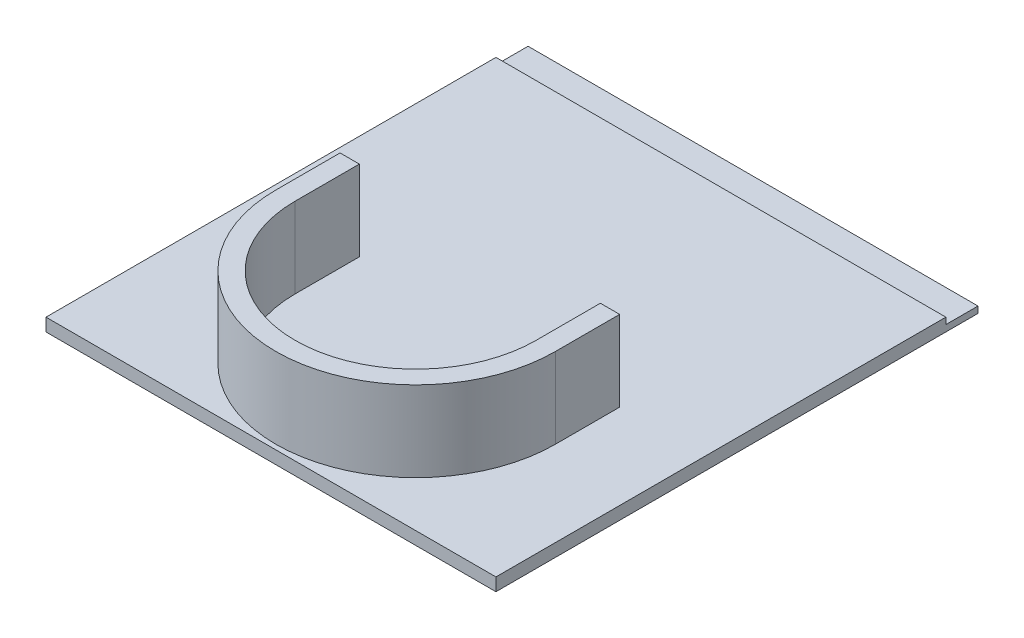
ISO-10303-21;
HEADER;
FILE_DESCRIPTION(('STEP AP214'),'2;1');
FILE_NAME('part.step','',(''),(''),'','','');
FILE_SCHEMA(('AUTOMOTIVE_DESIGN { 1 0 10303 214 1 1 1 1 }'));
ENDSEC;
DATA;
#1=APPLICATION_CONTEXT('core data for automotive mechanical design processes');
#2=APPLICATION_PROTOCOL_DEFINITION('international standard','automotive_design',2000,#1);
#3=PRODUCT_CONTEXT('',#1,'mechanical');
#4=PRODUCT('Part','Part','',(#3));
#5=PRODUCT_RELATED_PRODUCT_CATEGORY('part','',(#4));
#6=PRODUCT_DEFINITION_FORMATION('','',#4);
#7=PRODUCT_DEFINITION_CONTEXT('part definition',#1,'design');
#8=PRODUCT_DEFINITION('design','',#6,#7);
#9=PRODUCT_DEFINITION_SHAPE('','',#8);
#10=(LENGTH_UNIT() NAMED_UNIT(*) SI_UNIT(.MILLI.,.METRE.));
#11=(NAMED_UNIT(*) PLANE_ANGLE_UNIT() SI_UNIT($,.RADIAN.));
#12=(NAMED_UNIT(*) SI_UNIT($,.STERADIAN.) SOLID_ANGLE_UNIT());
#13=UNCERTAINTY_MEASURE_WITH_UNIT(LENGTH_MEASURE(1.E-05),#10,'distance_accuracy_value','');
#14=(GEOMETRIC_REPRESENTATION_CONTEXT(3) GLOBAL_UNCERTAINTY_ASSIGNED_CONTEXT((#13)) GLOBAL_UNIT_ASSIGNED_CONTEXT((#10,
#11,#12)) REPRESENTATION_CONTEXT('',''));
#15=CARTESIAN_POINT('',(0.,0.,0.));
#16=DIRECTION('',(0.,0.,1.));
#17=DIRECTION('',(1.,0.,0.));
#18=AXIS2_PLACEMENT_3D('',#15,#16,#17);
#19=CARTESIAN_POINT('',(0.,4.,0.));
#20=DIRECTION('',(0.,1.,0.));
#21=DIRECTION('',(0.,0.,1.));
#22=AXIS2_PLACEMENT_3D('',#19,#20,#21);
#23=PLANE('',#22);
#24=DIRECTION('',(0.,0.,1.));
#25=VECTOR('',#24,1.);
#26=CARTESIAN_POINT('',(-43.5,4.,145.));
#27=LINE('',#26,#25);
#28=CARTESIAN_POINT('',(-43.5,4.,145.));
#29=VERTEX_POINT('',#28);
#30=CARTESIAN_POINT('',(-43.5,4.,165.));
#31=VERTEX_POINT('',#30);
#32=EDGE_CURVE('E225',#29,#31,#27,.T.);
#33=ORIENTED_EDGE('',*,*,#32,.F.);
#34=DIRECTION('',(-1.,0.,0.));
#35=VECTOR('',#34,1.);
#36=CARTESIAN_POINT('',(-37.5,4.,145.));
#37=LINE('',#36,#35);
#38=CARTESIAN_POINT('',(-37.5,4.,145.));
#39=VERTEX_POINT('',#38);
#40=EDGE_CURVE('E190',#39,#29,#37,.T.);
#41=ORIENTED_EDGE('',*,*,#40,.F.);
#42=DIRECTION('',(0.,0.,-1.));
#43=VECTOR('',#42,1.);
#44=CARTESIAN_POINT('',(-37.5,4.,165.));
#45=LINE('',#44,#43);
#46=CARTESIAN_POINT('',(-37.5,4.,165.));
#47=VERTEX_POINT('',#46);
#48=EDGE_CURVE('E196',#47,#39,#45,.T.);
#49=ORIENTED_EDGE('',*,*,#48,.F.);
#50=CARTESIAN_POINT('',(0.,4.,165.));
#51=DIRECTION('',(0.,1.,0.));
#52=DIRECTION('',(0.,0.,1.));
#53=AXIS2_PLACEMENT_3D('',#50,#51,#52);
#54=CIRCLE('',#53,37.5);
#55=CARTESIAN_POINT('',(37.5,4.,165.));
#56=VERTEX_POINT('',#55);
#57=EDGE_CURVE('E67',#47,#56,#54,.T.);
#58=ORIENTED_EDGE('',*,*,#57,.T.);
#59=DIRECTION('',(0.,0.,-1.));
#60=VECTOR('',#59,1.);
#61=CARTESIAN_POINT('',(37.5,4.,165.));
#62=LINE('',#61,#60);
#63=CARTESIAN_POINT('',(37.5,4.,145.));
#64=VERTEX_POINT('',#63);
#65=EDGE_CURVE('E240',#56,#64,#62,.T.);
#66=ORIENTED_EDGE('',*,*,#65,.T.);
#67=DIRECTION('',(1.,0.,0.));
#68=VECTOR('',#67,1.);
#69=CARTESIAN_POINT('',(37.5,4.,145.));
#70=LINE('',#69,#68);
#71=CARTESIAN_POINT('',(43.5,4.,145.));
#72=VERTEX_POINT('',#71);
#73=EDGE_CURVE('E236',#64,#72,#70,.T.);
#74=ORIENTED_EDGE('',*,*,#73,.T.);
#75=DIRECTION('',(0.,0.,1.));
#76=VECTOR('',#75,1.);
#77=CARTESIAN_POINT('',(43.5,4.,145.));
#78=LINE('',#77,#76);
#79=CARTESIAN_POINT('',(43.5,4.,165.));
#80=VERTEX_POINT('',#79);
#81=EDGE_CURVE('E232',#72,#80,#78,.T.);
#82=ORIENTED_EDGE('',*,*,#81,.T.);
#83=CARTESIAN_POINT('',(0.,4.,165.));
#84=DIRECTION('',(0.,1.,0.));
#85=DIRECTION('',(0.,0.,1.));
#86=AXIS2_PLACEMENT_3D('',#83,#84,#85);
#87=CIRCLE('',#86,43.5);
#88=EDGE_CURVE('E228',#31,#80,#87,.T.);
#89=ORIENTED_EDGE('',*,*,#88,.F.);
#90=EDGE_LOOP('',(#33,#41,#49,#58,#66,#74,#82,#89));
#91=FACE_BOUND('',#90,.T.);
#92=DIRECTION('',(0.,0.,-1.));
#93=VECTOR('',#92,1.);
#94=CARTESIAN_POINT('',(70.,4.,-210.));
#95=LINE('',#94,#93);
#96=CARTESIAN_POINT('',(70.,4.,210.));
#97=VERTEX_POINT('',#96);
#98=CARTESIAN_POINT('',(70.,4.00000000000001,69.9999999999999));
#99=VERTEX_POINT('',#98);
#100=EDGE_CURVE('E274',#97,#99,#95,.T.);
#101=ORIENTED_EDGE('',*,*,#100,.T.);
#102=DIRECTION('',(-1.,0.,0.));
#103=VECTOR('',#102,1.);
#104=CARTESIAN_POINT('',(0.,4.,69.9999999999999));
#105=LINE('',#104,#103);
#106=CARTESIAN_POINT('',(-70.,4.00000000000001,69.9999999999999));
#107=VERTEX_POINT('',#106);
#108=EDGE_CURVE('E184',#99,#107,#105,.T.);
#109=ORIENTED_EDGE('',*,*,#108,.T.);
#110=DIRECTION('',(0.,0.,1.));
#111=VECTOR('',#110,1.);
#112=CARTESIAN_POINT('',(-70.,4.,-210.));
#113=LINE('',#112,#111);
#114=CARTESIAN_POINT('',(-70.,4.,210.));
#115=VERTEX_POINT('',#114);
#116=EDGE_CURVE('E278',#107,#115,#113,.T.);
#117=ORIENTED_EDGE('',*,*,#116,.T.);
#118=DIRECTION('',(1.,0.,0.));
#119=VECTOR('',#118,1.);
#120=CARTESIAN_POINT('',(-70.,4.,210.));
#121=LINE('',#120,#119);
#122=EDGE_CURVE('E282',#115,#97,#121,.T.);
#123=ORIENTED_EDGE('',*,*,#122,.T.);
#124=EDGE_LOOP('',(#101,#109,#117,#123));
#125=FACE_BOUND('',#124,.T.);
#126=ADVANCED_FACE('F43',(#91,#125),#23,.T.);
#127=CARTESIAN_POINT('',(70.,4.,-210.));
#128=DIRECTION('',(-1.,0.,0.));
#129=DIRECTION('',(0.,0.,1.));
#130=AXIS2_PLACEMENT_3D('',#127,#128,#129);
#131=PLANE('',#130);
#132=DIRECTION('',(0.,-1.,0.));
#133=VECTOR('',#132,1.);
#134=CARTESIAN_POINT('',(70.,29.,69.9999999999999));
#135=LINE('',#134,#133);
#136=CARTESIAN_POINT('',(70.,2.,69.9999999999999));
#137=VERTEX_POINT('',#136);
#138=EDGE_CURVE('E180',#99,#137,#135,.T.);
#139=ORIENTED_EDGE('',*,*,#138,.F.);
#140=ORIENTED_EDGE('',*,*,#100,.F.);
#141=DIRECTION('',(0.,-1.,0.));
#142=VECTOR('',#141,1.);
#143=CARTESIAN_POINT('',(70.,4.,210.));
#144=LINE('',#143,#142);
#145=CARTESIAN_POINT('',(70.,0.,210.));
#146=VERTEX_POINT('',#145);
#147=EDGE_CURVE('E52',#97,#146,#144,.T.);
#148=ORIENTED_EDGE('',*,*,#147,.T.);
#149=DIRECTION('',(0.,0.,-1.));
#150=VECTOR('',#149,1.);
#151=CARTESIAN_POINT('',(70.,0.,-210.));
#152=LINE('',#151,#150);
#153=CARTESIAN_POINT('',(70.,0.,59.9999999999999));
#154=VERTEX_POINT('',#153);
#155=EDGE_CURVE('E273',#146,#154,#152,.T.);
#156=ORIENTED_EDGE('',*,*,#155,.T.);
#157=DIRECTION('',(0.,-1.,0.));
#158=VECTOR('',#157,1.);
#159=CARTESIAN_POINT('',(70.,2.,59.9999999999999));
#160=LINE('',#159,#158);
#161=CARTESIAN_POINT('',(70.,2.,59.9999999999999));
#162=VERTEX_POINT('',#161);
#163=EDGE_CURVE('E156',#162,#154,#160,.T.);
#164=ORIENTED_EDGE('',*,*,#163,.F.);
#165=DIRECTION('',(0.,0.,-1.));
#166=VECTOR('',#165,1.);
#167=CARTESIAN_POINT('',(70.,2.,69.9999999999999));
#168=LINE('',#167,#166);
#169=EDGE_CURVE('E163',#137,#162,#168,.T.);
#170=ORIENTED_EDGE('',*,*,#169,.F.);
#171=EDGE_LOOP('',(#139,#140,#148,#156,#164,#170));
#172=FACE_BOUND('',#171,.T.);
#173=ADVANCED_FACE('F45',(#172),#131,.F.);
#174=CARTESIAN_POINT('',(-70.,4.,-210.));
#175=DIRECTION('',(1.,0.,0.));
#176=DIRECTION('',(0.,0.,-1.));
#177=AXIS2_PLACEMENT_3D('',#174,#175,#176);
#178=PLANE('',#177);
#179=DIRECTION('',(0.,-1.,0.));
#180=VECTOR('',#179,1.);
#181=CARTESIAN_POINT('',(-70.,29.,69.9999999999999));
#182=LINE('',#181,#180);
#183=CARTESIAN_POINT('',(-70.,2.00000000000001,69.9999999999999));
#184=VERTEX_POINT('',#183);
#185=EDGE_CURVE('E169',#107,#184,#182,.T.);
#186=ORIENTED_EDGE('',*,*,#185,.T.);
#187=DIRECTION('',(0.,0.,-1.));
#188=VECTOR('',#187,1.);
#189=CARTESIAN_POINT('',(-70.,2.,69.9999999999999));
#190=LINE('',#189,#188);
#191=CARTESIAN_POINT('',(-70.,2.,59.9999999999999));
#192=VERTEX_POINT('',#191);
#193=EDGE_CURVE('E161',#184,#192,#190,.T.);
#194=ORIENTED_EDGE('',*,*,#193,.T.);
#195=DIRECTION('',(0.,-1.,0.));
#196=VECTOR('',#195,1.);
#197=CARTESIAN_POINT('',(-70.,2.,59.9999999999999));
#198=LINE('',#197,#196);
#199=CARTESIAN_POINT('',(-70.,0.,59.9999999999999));
#200=VERTEX_POINT('',#199);
#201=EDGE_CURVE('E146',#192,#200,#198,.T.);
#202=ORIENTED_EDGE('',*,*,#201,.T.);
#203=DIRECTION('',(0.,0.,1.));
#204=VECTOR('',#203,1.);
#205=CARTESIAN_POINT('',(-70.,0.,-210.));
#206=LINE('',#205,#204);
#207=CARTESIAN_POINT('',(-70.,0.,210.));
#208=VERTEX_POINT('',#207);
#209=EDGE_CURVE('E287',#200,#208,#206,.T.);
#210=ORIENTED_EDGE('',*,*,#209,.T.);
#211=DIRECTION('',(0.,-1.,0.));
#212=VECTOR('',#211,1.);
#213=CARTESIAN_POINT('',(-70.,4.,210.));
#214=LINE('',#213,#212);
#215=EDGE_CURVE('E11',#115,#208,#214,.T.);
#216=ORIENTED_EDGE('',*,*,#215,.F.);
#217=ORIENTED_EDGE('',*,*,#116,.F.);
#218=EDGE_LOOP('',(#186,#194,#202,#210,#216,#217));
#219=FACE_BOUND('',#218,.T.);
#220=ADVANCED_FACE('F167',(#219),#178,.F.);
#221=CARTESIAN_POINT('',(0.,0.,0.));
#222=DIRECTION('',(0.,1.,0.));
#223=DIRECTION('',(0.,0.,1.));
#224=AXIS2_PLACEMENT_3D('',#221,#222,#223);
#225=PLANE('',#224);
#226=ORIENTED_EDGE('',*,*,#209,.F.);
#227=DIRECTION('',(1.,0.,0.));
#228=VECTOR('',#227,1.);
#229=CARTESIAN_POINT('',(-70.,0.,59.9999999999999));
#230=LINE('',#229,#228);
#231=EDGE_CURVE('E152',#200,#154,#230,.T.);
#232=ORIENTED_EDGE('',*,*,#231,.T.);
#233=ORIENTED_EDGE('',*,*,#155,.F.);
#234=DIRECTION('',(1.,0.,0.));
#235=VECTOR('',#234,1.);
#236=CARTESIAN_POINT('',(-70.,0.,210.));
#237=LINE('',#236,#235);
#238=EDGE_CURVE('E279',#208,#146,#237,.T.);
#239=ORIENTED_EDGE('',*,*,#238,.F.);
#240=EDGE_LOOP('',(#226,#232,#233,#239));
#241=FACE_BOUND('',#240,.T.);
#242=ADVANCED_FACE('F302',(#241),#225,.F.);
#243=CARTESIAN_POINT('',(-70.,4.,210.));
#244=DIRECTION('',(0.,0.,-1.));
#245=DIRECTION('',(-1.,0.,0.));
#246=AXIS2_PLACEMENT_3D('',#243,#244,#245);
#247=PLANE('',#246);
#248=ORIENTED_EDGE('',*,*,#238,.T.);
#249=ORIENTED_EDGE('',*,*,#147,.F.);
#250=ORIENTED_EDGE('',*,*,#122,.F.);
#251=ORIENTED_EDGE('',*,*,#215,.T.);
#252=EDGE_LOOP('',(#248,#249,#250,#251));
#253=FACE_BOUND('',#252,.T.);
#254=ADVANCED_FACE('F304',(#253),#247,.F.);
#255=CARTESIAN_POINT('',(-37.5,29.,145.));
#256=DIRECTION('',(0.,0.,1.));
#257=DIRECTION('',(1.,0.,0.));
#258=AXIS2_PLACEMENT_3D('',#255,#256,#257);
#259=PLANE('',#258);
#260=ORIENTED_EDGE('',*,*,#40,.T.);
#261=DIRECTION('',(0.,-1.,0.));
#262=VECTOR('',#261,1.);
#263=CARTESIAN_POINT('',(-43.5,29.,145.));
#264=LINE('',#263,#262);
#265=CARTESIAN_POINT('',(-43.5,29.,145.));
#266=VERTEX_POINT('',#265);
#267=EDGE_CURVE('E270',#266,#29,#264,.T.);
#268=ORIENTED_EDGE('',*,*,#267,.F.);
#269=DIRECTION('',(-1.,0.,0.));
#270=VECTOR('',#269,1.);
#271=CARTESIAN_POINT('',(-37.5,29.,145.));
#272=LINE('',#271,#270);
#273=CARTESIAN_POINT('',(-37.5,29.,145.));
#274=VERTEX_POINT('',#273);
#275=EDGE_CURVE('E191',#274,#266,#272,.T.);
#276=ORIENTED_EDGE('',*,*,#275,.F.);
#277=DIRECTION('',(0.,-1.,0.));
#278=VECTOR('',#277,1.);
#279=CARTESIAN_POINT('',(-37.5,29.,145.));
#280=LINE('',#279,#278);
#281=EDGE_CURVE('E221',#274,#39,#280,.T.);
#282=ORIENTED_EDGE('',*,*,#281,.T.);
#283=EDGE_LOOP('',(#260,#268,#276,#282));
#284=FACE_BOUND('',#283,.T.);
#285=ADVANCED_FACE('F330',(#284),#259,.F.);
#286=CARTESIAN_POINT('',(-43.5,29.,145.));
#287=DIRECTION('',(1.,0.,0.));
#288=DIRECTION('',(0.,0.,-1.));
#289=AXIS2_PLACEMENT_3D('',#286,#287,#288);
#290=PLANE('',#289);
#291=ORIENTED_EDGE('',*,*,#32,.T.);
#292=DIRECTION('',(0.,-1.,0.));
#293=VECTOR('',#292,1.);
#294=CARTESIAN_POINT('',(-43.5,29.,165.));
#295=LINE('',#294,#293);
#296=CARTESIAN_POINT('',(-43.5,29.,165.));
#297=VERTEX_POINT('',#296);
#298=EDGE_CURVE('E266',#297,#31,#295,.T.);
#299=ORIENTED_EDGE('',*,*,#298,.F.);
#300=DIRECTION('',(0.,0.,1.));
#301=VECTOR('',#300,1.);
#302=CARTESIAN_POINT('',(-43.5,29.,145.));
#303=LINE('',#302,#301);
#304=EDGE_CURVE('E195',#266,#297,#303,.T.);
#305=ORIENTED_EDGE('',*,*,#304,.F.);
#306=ORIENTED_EDGE('',*,*,#267,.T.);
#307=EDGE_LOOP('',(#291,#299,#305,#306));
#308=FACE_BOUND('',#307,.T.);
#309=ADVANCED_FACE('F436',(#308),#290,.F.);
#310=CARTESIAN_POINT('',(0.,29.,165.));
#311=DIRECTION('',(0.,-1.,0.));
#312=DIRECTION('',(0.,0.,-1.));
#313=AXIS2_PLACEMENT_3D('',#310,#311,#312);
#314=CYLINDRICAL_SURFACE('',#313,43.5);
#315=ORIENTED_EDGE('',*,*,#88,.T.);
#316=DIRECTION('',(0.,-1.,0.));
#317=VECTOR('',#316,1.);
#318=CARTESIAN_POINT('',(43.5,29.,165.));
#319=LINE('',#318,#317);
#320=CARTESIAN_POINT('',(43.5,29.,165.));
#321=VERTEX_POINT('',#320);
#322=EDGE_CURVE('E263',#321,#80,#319,.T.);
#323=ORIENTED_EDGE('',*,*,#322,.F.);
#324=CARTESIAN_POINT('',(0.,29.,165.));
#325=DIRECTION('',(0.,1.,0.));
#326=DIRECTION('',(0.,0.,1.));
#327=AXIS2_PLACEMENT_3D('',#324,#325,#326);
#328=CIRCLE('',#327,43.5);
#329=EDGE_CURVE('E199',#297,#321,#328,.T.);
#330=ORIENTED_EDGE('',*,*,#329,.F.);
#331=ORIENTED_EDGE('',*,*,#298,.T.);
#332=EDGE_LOOP('',(#315,#323,#330,#331));
#333=FACE_BOUND('',#332,.T.);
#334=ADVANCED_FACE('F427',(#333),#314,.T.);
#335=CARTESIAN_POINT('',(43.5,29.,145.));
#336=DIRECTION('',(1.,0.,0.));
#337=DIRECTION('',(0.,0.,-1.));
#338=AXIS2_PLACEMENT_3D('',#335,#336,#337);
#339=PLANE('',#338);
#340=ORIENTED_EDGE('',*,*,#81,.F.);
#341=DIRECTION('',(0.,-1.,0.));
#342=VECTOR('',#341,1.);
#343=CARTESIAN_POINT('',(43.5,29.,145.));
#344=LINE('',#343,#342);
#345=CARTESIAN_POINT('',(43.5,29.,145.));
#346=VERTEX_POINT('',#345);
#347=EDGE_CURVE('E260',#346,#72,#344,.T.);
#348=ORIENTED_EDGE('',*,*,#347,.F.);
#349=DIRECTION('',(0.,0.,1.));
#350=VECTOR('',#349,1.);
#351=CARTESIAN_POINT('',(43.5,29.,145.));
#352=LINE('',#351,#350);
#353=EDGE_CURVE('E202',#346,#321,#352,.T.);
#354=ORIENTED_EDGE('',*,*,#353,.T.);
#355=ORIENTED_EDGE('',*,*,#322,.T.);
#356=EDGE_LOOP('',(#340,#348,#354,#355));
#357=FACE_BOUND('',#356,.T.);
#358=ADVANCED_FACE('F418',(#357),#339,.T.);
#359=CARTESIAN_POINT('',(37.5,29.,145.));
#360=DIRECTION('',(0.,0.,-1.));
#361=DIRECTION('',(-1.,0.,0.));
#362=AXIS2_PLACEMENT_3D('',#359,#360,#361);
#363=PLANE('',#362);
#364=ORIENTED_EDGE('',*,*,#73,.F.);
#365=DIRECTION('',(0.,-1.,0.));
#366=VECTOR('',#365,1.);
#367=CARTESIAN_POINT('',(37.5,29.,145.));
#368=LINE('',#367,#366);
#369=CARTESIAN_POINT('',(37.5,29.,145.));
#370=VERTEX_POINT('',#369);
#371=EDGE_CURVE('E257',#370,#64,#368,.T.);
#372=ORIENTED_EDGE('',*,*,#371,.F.);
#373=DIRECTION('',(1.,0.,0.));
#374=VECTOR('',#373,1.);
#375=CARTESIAN_POINT('',(37.5,29.,145.));
#376=LINE('',#375,#374);
#377=EDGE_CURVE('E206',#370,#346,#376,.T.);
#378=ORIENTED_EDGE('',*,*,#377,.T.);
#379=ORIENTED_EDGE('',*,*,#347,.T.);
#380=EDGE_LOOP('',(#364,#372,#378,#379));
#381=FACE_BOUND('',#380,.T.);
#382=ADVANCED_FACE('F409',(#381),#363,.T.);
#383=CARTESIAN_POINT('',(37.5,29.,165.));
#384=DIRECTION('',(-1.,0.,0.));
#385=DIRECTION('',(0.,0.,1.));
#386=AXIS2_PLACEMENT_3D('',#383,#384,#385);
#387=PLANE('',#386);
#388=ORIENTED_EDGE('',*,*,#65,.F.);
#389=DIRECTION('',(0.,-1.,0.));
#390=VECTOR('',#389,1.);
#391=CARTESIAN_POINT('',(37.5,29.,165.));
#392=LINE('',#391,#390);
#393=CARTESIAN_POINT('',(37.5,29.,165.));
#394=VERTEX_POINT('',#393);
#395=EDGE_CURVE('E254',#394,#56,#392,.T.);
#396=ORIENTED_EDGE('',*,*,#395,.F.);
#397=DIRECTION('',(0.,0.,-1.));
#398=VECTOR('',#397,1.);
#399=CARTESIAN_POINT('',(37.5,29.,165.));
#400=LINE('',#399,#398);
#401=EDGE_CURVE('E210',#394,#370,#400,.T.);
#402=ORIENTED_EDGE('',*,*,#401,.T.);
#403=ORIENTED_EDGE('',*,*,#371,.T.);
#404=EDGE_LOOP('',(#388,#396,#402,#403));
#405=FACE_BOUND('',#404,.T.);
#406=ADVANCED_FACE('F401',(#405),#387,.T.);
#407=CARTESIAN_POINT('',(0.,29.,165.));
#408=DIRECTION('',(0.,-1.,0.));
#409=DIRECTION('',(0.,0.,-1.));
#410=AXIS2_PLACEMENT_3D('',#407,#408,#409);
#411=CYLINDRICAL_SURFACE('',#410,37.5);
#412=ORIENTED_EDGE('',*,*,#57,.F.);
#413=DIRECTION('',(0.,-1.,0.));
#414=VECTOR('',#413,1.);
#415=CARTESIAN_POINT('',(-37.5,29.,165.));
#416=LINE('',#415,#414);
#417=CARTESIAN_POINT('',(-37.5,29.,165.));
#418=VERTEX_POINT('',#417);
#419=EDGE_CURVE('E251',#418,#47,#416,.T.);
#420=ORIENTED_EDGE('',*,*,#419,.F.);
#421=CARTESIAN_POINT('',(0.,29.,165.));
#422=DIRECTION('',(0.,1.,0.));
#423=DIRECTION('',(0.,0.,1.));
#424=AXIS2_PLACEMENT_3D('',#421,#422,#423);
#425=CIRCLE('',#424,37.5);
#426=EDGE_CURVE('E214',#418,#394,#425,.T.);
#427=ORIENTED_EDGE('',*,*,#426,.T.);
#428=ORIENTED_EDGE('',*,*,#395,.T.);
#429=EDGE_LOOP('',(#412,#420,#427,#428));
#430=FACE_BOUND('',#429,.T.);
#431=ADVANCED_FACE('F392',(#430),#411,.F.);
#432=CARTESIAN_POINT('',(-37.5,29.,165.));
#433=DIRECTION('',(-1.,0.,0.));
#434=DIRECTION('',(0.,0.,1.));
#435=AXIS2_PLACEMENT_3D('',#432,#433,#434);
#436=PLANE('',#435);
#437=ORIENTED_EDGE('',*,*,#48,.T.);
#438=ORIENTED_EDGE('',*,*,#281,.F.);
#439=DIRECTION('',(0.,0.,-1.));
#440=VECTOR('',#439,1.);
#441=CARTESIAN_POINT('',(-37.5,29.,165.));
#442=LINE('',#441,#440);
#443=EDGE_CURVE('E218',#418,#274,#442,.T.);
#444=ORIENTED_EDGE('',*,*,#443,.F.);
#445=ORIENTED_EDGE('',*,*,#419,.T.);
#446=EDGE_LOOP('',(#437,#438,#444,#445));
#447=FACE_BOUND('',#446,.T.);
#448=ADVANCED_FACE('F316',(#447),#436,.F.);
#449=CARTESIAN_POINT('',(0.,29.,165.));
#450=DIRECTION('',(0.,1.,0.));
#451=DIRECTION('',(0.,0.,1.));
#452=AXIS2_PLACEMENT_3D('',#449,#450,#451);
#453=PLANE('',#452);
#454=ORIENTED_EDGE('',*,*,#275,.T.);
#455=ORIENTED_EDGE('',*,*,#304,.T.);
#456=ORIENTED_EDGE('',*,*,#329,.T.);
#457=ORIENTED_EDGE('',*,*,#353,.F.);
#458=ORIENTED_EDGE('',*,*,#377,.F.);
#459=ORIENTED_EDGE('',*,*,#401,.F.);
#460=ORIENTED_EDGE('',*,*,#426,.F.);
#461=ORIENTED_EDGE('',*,*,#443,.T.);
#462=EDGE_LOOP('',(#454,#455,#456,#457,#458,#459,#460,#461));
#463=FACE_BOUND('',#462,.T.);
#464=ADVANCED_FACE('F308',(#463),#453,.T.);
#465=CARTESIAN_POINT('',(0.,29.,69.9999999999999));
#466=DIRECTION('',(0.,0.,-1.));
#467=DIRECTION('',(-1.,0.,0.));
#468=AXIS2_PLACEMENT_3D('',#465,#466,#467);
#469=PLANE('',#468);
#470=DIRECTION('',(1.,0.,0.));
#471=VECTOR('',#470,1.);
#472=CARTESIAN_POINT('',(-70.,2.,69.9999999999999));
#473=LINE('',#472,#471);
#474=EDGE_CURVE('E59',#184,#137,#473,.T.);
#475=ORIENTED_EDGE('',*,*,#474,.F.);
#476=ORIENTED_EDGE('',*,*,#185,.F.);
#477=ORIENTED_EDGE('',*,*,#108,.F.);
#478=ORIENTED_EDGE('',*,*,#138,.T.);
#479=EDGE_LOOP('',(#475,#476,#477,#478));
#480=FACE_BOUND('',#479,.T.);
#481=ADVANCED_FACE('F306',(#480),#469,.T.);
#482=CARTESIAN_POINT('',(-70.,2.,59.9999999999999));
#483=DIRECTION('',(0.,0.,-1.));
#484=DIRECTION('',(-1.,0.,0.));
#485=AXIS2_PLACEMENT_3D('',#482,#483,#484);
#486=PLANE('',#485);
#487=ORIENTED_EDGE('',*,*,#231,.F.);
#488=ORIENTED_EDGE('',*,*,#201,.F.);
#489=DIRECTION('',(1.,0.,0.));
#490=VECTOR('',#489,1.);
#491=CARTESIAN_POINT('',(-70.,2.,59.9999999999999));
#492=LINE('',#491,#490);
#493=EDGE_CURVE('E150',#192,#162,#492,.T.);
#494=ORIENTED_EDGE('',*,*,#493,.T.);
#495=ORIENTED_EDGE('',*,*,#163,.T.);
#496=EDGE_LOOP('',(#487,#488,#494,#495));
#497=FACE_BOUND('',#496,.T.);
#498=ADVANCED_FACE('F148',(#497),#486,.T.);
#499=CARTESIAN_POINT('',(0.,2.,0.));
#500=DIRECTION('',(0.,-1.,0.));
#501=DIRECTION('',(0.,0.,-1.));
#502=AXIS2_PLACEMENT_3D('',#499,#500,#501);
#503=PLANE('',#502);
#504=ORIENTED_EDGE('',*,*,#193,.F.);
#505=ORIENTED_EDGE('',*,*,#474,.T.);
#506=ORIENTED_EDGE('',*,*,#169,.T.);
#507=ORIENTED_EDGE('',*,*,#493,.F.);
#508=EDGE_LOOP('',(#504,#505,#506,#507));
#509=FACE_BOUND('',#508,.T.);
#510=ADVANCED_FACE('F160',(#509),#503,.F.);
#511=CLOSED_SHELL('',(#126,#173,#220,#242,#254,#285,#309,#334,#358,#382,#406,#431,#448,#464,
#481,#498,#510));
#512=MANIFOLD_SOLID_BREP('B2',#511);
#513=ADVANCED_BREP_SHAPE_REPRESENTATION('',(#18,#512),#14);
#514=SHAPE_DEFINITION_REPRESENTATION(#9,#513);
ENDSEC;
END-ISO-10303-21;
